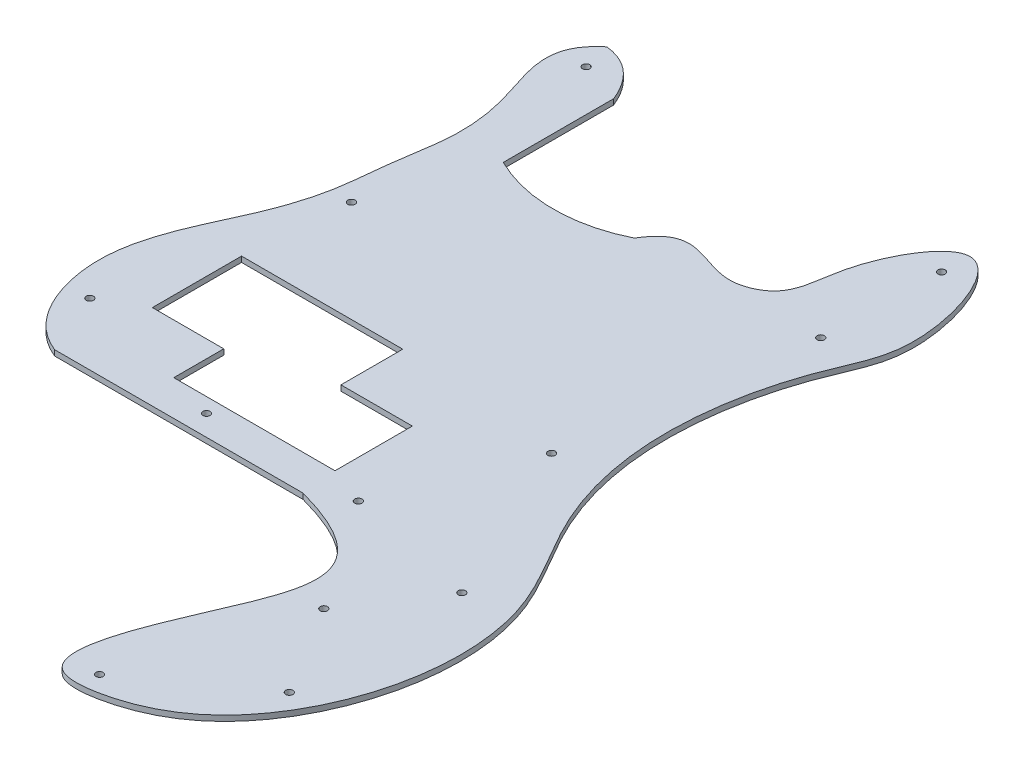
ISO-10303-21;
HEADER;
FILE_DESCRIPTION(('STEP AP214'),'2;1');
FILE_NAME('part.step','',(''),(''),'','','');
FILE_SCHEMA(('AUTOMOTIVE_DESIGN { 1 0 10303 214 1 1 1 1 }'));
ENDSEC;
DATA;
#1=APPLICATION_CONTEXT('core data for automotive mechanical design processes');
#2=APPLICATION_PROTOCOL_DEFINITION('international standard','automotive_design',2000,#1);
#3=PRODUCT_CONTEXT('',#1,'mechanical');
#4=PRODUCT('Part','Part','',(#3));
#5=PRODUCT_RELATED_PRODUCT_CATEGORY('part','',(#4));
#6=PRODUCT_DEFINITION_FORMATION('','',#4);
#7=PRODUCT_DEFINITION_CONTEXT('part definition',#1,'design');
#8=PRODUCT_DEFINITION('design','',#6,#7);
#9=PRODUCT_DEFINITION_SHAPE('','',#8);
#10=(LENGTH_UNIT() NAMED_UNIT(*) SI_UNIT(.MILLI.,.METRE.));
#11=(NAMED_UNIT(*) PLANE_ANGLE_UNIT() SI_UNIT($,.RADIAN.));
#12=(NAMED_UNIT(*) SI_UNIT($,.STERADIAN.) SOLID_ANGLE_UNIT());
#13=UNCERTAINTY_MEASURE_WITH_UNIT(LENGTH_MEASURE(1.E-05),#10,'distance_accuracy_value','');
#14=(GEOMETRIC_REPRESENTATION_CONTEXT(3) GLOBAL_UNCERTAINTY_ASSIGNED_CONTEXT((#13)) GLOBAL_UNIT_ASSIGNED_CONTEXT((#10,
#11,#12)) REPRESENTATION_CONTEXT('',''));
#15=CARTESIAN_POINT('',(0.,0.,0.));
#16=DIRECTION('',(0.,0.,1.));
#17=DIRECTION('',(1.,0.,0.));
#18=AXIS2_PLACEMENT_3D('',#15,#16,#17);
#19=CARTESIAN_POINT('',(0.,2.54,0.));
#20=DIRECTION('',(0.,0.,-1.));
#21=DIRECTION('',(-1.,0.,0.));
#22=AXIS2_PLACEMENT_3D('',#19,#20,#21);
#23=PLANE('',#22);
#24=DIRECTION('',(1.,0.,0.));
#25=VECTOR('',#24,1.);
#26=CARTESIAN_POINT('',(0.,0.,0.));
#27=LINE('',#26,#25);
#28=CARTESIAN_POINT('',(0.,0.,0.));
#29=VERTEX_POINT('',#28);
#30=CARTESIAN_POINT('',(114.3,0.,0.));
#31=VERTEX_POINT('',#30);
#32=EDGE_CURVE('E365',#29,#31,#27,.T.);
#33=ORIENTED_EDGE('',*,*,#32,.T.);
#34=DIRECTION('',(0.,-1.,0.));
#35=VECTOR('',#34,1.);
#36=CARTESIAN_POINT('',(114.3,2.54,0.));
#37=LINE('',#36,#35);
#38=CARTESIAN_POINT('',(114.3,2.54,0.));
#39=VERTEX_POINT('',#38);
#40=EDGE_CURVE('E11',#39,#31,#37,.T.);
#41=ORIENTED_EDGE('',*,*,#40,.F.);
#42=DIRECTION('',(1.,0.,0.));
#43=VECTOR('',#42,1.);
#44=CARTESIAN_POINT('',(0.,2.54,0.));
#45=LINE('',#44,#43);
#46=CARTESIAN_POINT('',(0.,2.54,0.));
#47=VERTEX_POINT('',#46);
#48=EDGE_CURVE('E252',#47,#39,#45,.T.);
#49=ORIENTED_EDGE('',*,*,#48,.F.);
#50=DIRECTION('',(0.,-1.,0.));
#51=VECTOR('',#50,1.);
#52=CARTESIAN_POINT('',(0.,2.54,0.));
#53=LINE('',#52,#51);
#54=EDGE_CURVE('E394',#47,#29,#53,.T.);
#55=ORIENTED_EDGE('',*,*,#54,.T.);
#56=EDGE_LOOP('',(#33,#41,#49,#55));
#57=FACE_BOUND('',#56,.T.);
#58=ADVANCED_FACE('F45',(#57),#23,.F.);
#59=CARTESIAN_POINT('',(114.3,2.54,0.));
#60=CARTESIAN_POINT('',(170.62319211353,2.54,15.3244998269789));
#61=CARTESIAN_POINT('',(142.778538687645,2.54,51.01482615215));
#62=CARTESIAN_POINT('',(117.07237008496,2.54,130.865354033399));
#63=CARTESIAN_POINT('',(166.910373226998,2.54,124.747305795916));
#64=CARTESIAN_POINT('',(211.27004330373,2.54,85.6480945359383));
#65=CARTESIAN_POINT('',(223.254152948572,2.54,5.84316240995028));
#66=CARTESIAN_POINT('',(185.826230853878,2.54,-45.0846803202027));
#67=CARTESIAN_POINT('',(168.892743993286,2.54,-100.701866142088));
#68=CARTESIAN_POINT('',(177.456556307914,2.54,-154.682991229981));
#69=CARTESIAN_POINT('',(201.016482926726,2.54,-201.558360825542));
#70=CARTESIAN_POINT('',(177.939980570624,2.54,-271.83735916786));
#71=CARTESIAN_POINT('',(147.118130497066,2.54,-218.136283800115));
#72=CARTESIAN_POINT('',(148.12807589294,2.54,-189.82980196272));
#73=CARTESIAN_POINT('',(118.716390008098,2.54,-176.497868685081));
#74=CARTESIAN_POINT('',(100.979559676119,2.54,-198.21058265065));
#75=CARTESIAN_POINT('',(88.9,2.54,-177.8));
#76=B_SPLINE_CURVE_WITH_KNOTS('',3,(#59,#60,#61,#62,#63,#64,#65,#66,#67,#68,#69,#70,#71,#72,#73,
#74,#75),.UNSPECIFIED.,.F.,.F.,(4,1,1,1,1,1,1,1,1,1,1,1,1,1,4),(0.,0.148092664495598,
0.210362687240337,0.240168738073211,0.321979976329545,0.461111394362021,0.528032739151517,
0.586689277761281,0.706181910966103,0.742682380383106,0.823050715857984,0.881913078401273,
0.917688904837905,0.939312918195722,1.),.UNSPECIFIED.);
#77=DIRECTION('',(0.,-1.,0.));
#78=VECTOR('',#77,1.);
#79=SURFACE_OF_LINEAR_EXTRUSION('',#76,#78);
#80=CARTESIAN_POINT('',(114.3,0.,0.));
#81=CARTESIAN_POINT('',(170.62319211353,0.,15.3244998269789));
#82=CARTESIAN_POINT('',(142.778538687645,0.,51.01482615215));
#83=CARTESIAN_POINT('',(117.07237008496,0.,130.865354033399));
#84=CARTESIAN_POINT('',(166.910373226998,0.,124.747305795916));
#85=CARTESIAN_POINT('',(211.27004330373,0.,85.6480945359383));
#86=CARTESIAN_POINT('',(223.254152948572,0.,5.84316240995028));
#87=CARTESIAN_POINT('',(185.826230853878,0.,-45.0846803202027));
#88=CARTESIAN_POINT('',(168.892743993286,0.,-100.701866142088));
#89=CARTESIAN_POINT('',(177.456556307914,0.,-154.682991229981));
#90=CARTESIAN_POINT('',(201.016482926726,0.,-201.558360825542));
#91=CARTESIAN_POINT('',(177.939980570624,0.,-271.83735916786));
#92=CARTESIAN_POINT('',(147.118130497066,0.,-218.136283800115));
#93=CARTESIAN_POINT('',(148.12807589294,0.,-189.82980196272));
#94=CARTESIAN_POINT('',(118.716390008098,0.,-176.497868685081));
#95=CARTESIAN_POINT('',(100.979559676119,0.,-198.21058265065));
#96=CARTESIAN_POINT('',(88.9,0.,-177.8));
#97=B_SPLINE_CURVE_WITH_KNOTS('',3,(#80,#81,#82,#83,#84,#85,#86,#87,#88,#89,#90,#91,#92,#93,#94,
#95,#96),.UNSPECIFIED.,.F.,.F.,(4,1,1,1,1,1,1,1,1,1,1,1,1,1,4),(0.,0.148092664495598,
0.210362687240337,0.240168738073211,0.321979976329545,0.461111394362021,0.528032739151517,
0.586689277761281,0.706181910966103,0.742682380383106,0.823050715857984,0.881913078401273,
0.917688904837905,0.939312918195722,1.),.UNSPECIFIED.);
#98=CARTESIAN_POINT('',(88.9,0.,-177.8));
#99=VERTEX_POINT('',#98);
#100=EDGE_CURVE('E368',#31,#99,#97,.T.);
#101=ORIENTED_EDGE('',*,*,#100,.T.);
#102=DIRECTION('',(0.,-1.,0.));
#103=VECTOR('',#102,1.);
#104=CARTESIAN_POINT('',(88.9,2.54,-177.8));
#105=LINE('',#104,#103);
#106=CARTESIAN_POINT('',(88.9,2.54,-177.8));
#107=VERTEX_POINT('',#106);
#108=EDGE_CURVE('E53',#107,#99,#105,.T.);
#109=ORIENTED_EDGE('',*,*,#108,.F.);
#110=EDGE_CURVE('E255',#39,#107,#76,.T.);
#111=ORIENTED_EDGE('',*,*,#110,.F.);
#112=ORIENTED_EDGE('',*,*,#40,.T.);
#113=EDGE_LOOP('',(#101,#109,#111,#112));
#114=FACE_BOUND('',#113,.T.);
#115=ADVANCED_FACE('F266',(#114),#79,.F.);
#116=CARTESIAN_POINT('',(58.7375,2.54,-238.204658482143));
#117=DIRECTION('',(0.,-1.,0.));
#118=DIRECTION('',(0.,0.,-1.));
#119=AXIS2_PLACEMENT_3D('',#116,#117,#118);
#120=CYLINDRICAL_SURFACE('',#119,67.5166584821429);
#121=CARTESIAN_POINT('',(58.7375,0.,-238.204658482143));
#122=DIRECTION('',(0.,1.,0.));
#123=DIRECTION('',(0.,0.,1.));
#124=AXIS2_PLACEMENT_3D('',#121,#122,#123);
#125=CIRCLE('',#124,67.5166584821429);
#126=CARTESIAN_POINT('',(28.575,0.,-177.8));
#127=VERTEX_POINT('',#126);
#128=EDGE_CURVE('E373',#127,#99,#125,.T.);
#129=ORIENTED_EDGE('',*,*,#128,.F.);
#130=DIRECTION('',(0.,-1.,0.));
#131=VECTOR('',#130,1.);
#132=CARTESIAN_POINT('',(28.575,2.54,-177.8));
#133=LINE('',#132,#131);
#134=CARTESIAN_POINT('',(28.575,2.54,-177.8));
#135=VERTEX_POINT('',#134);
#136=EDGE_CURVE('E404',#135,#127,#133,.T.);
#137=ORIENTED_EDGE('',*,*,#136,.F.);
#138=CARTESIAN_POINT('',(58.7375,2.54,-238.204658482143));
#139=DIRECTION('',(0.,1.,0.));
#140=DIRECTION('',(0.,0.,1.));
#141=AXIS2_PLACEMENT_3D('',#138,#139,#140);
#142=CIRCLE('',#141,67.5166584821429);
#143=EDGE_CURVE('E260',#135,#107,#142,.T.);
#144=ORIENTED_EDGE('',*,*,#143,.T.);
#145=ORIENTED_EDGE('',*,*,#108,.T.);
#146=EDGE_LOOP('',(#129,#137,#144,#145));
#147=FACE_BOUND('',#146,.T.);
#148=ADVANCED_FACE('F270',(#147),#120,.F.);
#149=CARTESIAN_POINT('',(28.575,2.54,0.));
#150=DIRECTION('',(1.,0.,0.));
#151=DIRECTION('',(0.,0.,-1.));
#152=AXIS2_PLACEMENT_3D('',#149,#150,#151);
#153=PLANE('',#152);
#154=DIRECTION('',(0.,0.,1.));
#155=VECTOR('',#154,1.);
#156=CARTESIAN_POINT('',(28.575,0.,0.));
#157=LINE('',#156,#155);
#158=CARTESIAN_POINT('',(28.575,0.,-228.6));
#159=VERTEX_POINT('',#158);
#160=EDGE_CURVE('E379',#159,#127,#157,.T.);
#161=ORIENTED_EDGE('',*,*,#160,.F.);
#162=DIRECTION('',(0.,-1.,0.));
#163=VECTOR('',#162,1.);
#164=CARTESIAN_POINT('',(28.575,2.54,-228.6));
#165=LINE('',#164,#163);
#166=CARTESIAN_POINT('',(28.575,2.54,-228.6));
#167=VERTEX_POINT('',#166);
#168=EDGE_CURVE('E402',#167,#159,#165,.T.);
#169=ORIENTED_EDGE('',*,*,#168,.F.);
#170=DIRECTION('',(0.,0.,1.));
#171=VECTOR('',#170,1.);
#172=CARTESIAN_POINT('',(28.575,2.54,0.));
#173=LINE('',#172,#171);
#174=EDGE_CURVE('E419',#167,#135,#173,.T.);
#175=ORIENTED_EDGE('',*,*,#174,.T.);
#176=ORIENTED_EDGE('',*,*,#136,.T.);
#177=EDGE_LOOP('',(#161,#169,#175,#176));
#178=FACE_BOUND('',#177,.T.);
#179=ADVANCED_FACE('F416',(#178),#153,.T.);
#180=CARTESIAN_POINT('',(6.35000000000001,2.54,-247.65));
#181=CARTESIAN_POINT('',(21.4241263145795,2.54,-246.03002734654));
#182=CARTESIAN_POINT('',(28.575,2.54,-228.6));
#183=B_SPLINE_CURVE_WITH_KNOTS('',2,(#180,#181,#182),.UNSPECIFIED.,.F.,.F.,(3,3),(0.,1.),.UNSPECIFIED.);
#184=DIRECTION('',(0.,-1.,0.));
#185=VECTOR('',#184,1.);
#186=SURFACE_OF_LINEAR_EXTRUSION('',#183,#185);
#187=CARTESIAN_POINT('',(6.35000000000001,0.,-247.65));
#188=CARTESIAN_POINT('',(21.4241263145795,0.,-246.03002734654));
#189=CARTESIAN_POINT('',(28.575,0.,-228.6));
#190=B_SPLINE_CURVE_WITH_KNOTS('',2,(#187,#188,#189),.UNSPECIFIED.,.F.,.F.,(3,3),(0.,1.),.UNSPECIFIED.);
#191=CARTESIAN_POINT('',(6.35000000000001,0.,-247.65));
#192=VERTEX_POINT('',#191);
#193=EDGE_CURVE('E382',#192,#159,#190,.T.);
#194=ORIENTED_EDGE('',*,*,#193,.F.);
#195=DIRECTION('',(0.,-1.,0.));
#196=VECTOR('',#195,1.);
#197=CARTESIAN_POINT('',(6.35000000000001,2.54,-247.65));
#198=LINE('',#197,#196);
#199=CARTESIAN_POINT('',(6.35000000000001,2.54,-247.65));
#200=VERTEX_POINT('',#199);
#201=EDGE_CURVE('E399',#200,#192,#198,.T.);
#202=ORIENTED_EDGE('',*,*,#201,.F.);
#203=EDGE_CURVE('E424',#200,#167,#183,.T.);
#204=ORIENTED_EDGE('',*,*,#203,.T.);
#205=ORIENTED_EDGE('',*,*,#168,.T.);
#206=EDGE_LOOP('',(#194,#202,#204,#205));
#207=FACE_BOUND('',#206,.T.);
#208=ADVANCED_FACE('F280',(#207),#186,.T.);
#209=CARTESIAN_POINT('',(165.1,2.54,41.275));
#210=DIRECTION('',(0.,-1.,0.));
#211=DIRECTION('',(0.,0.,-1.));
#212=AXIS2_PLACEMENT_3D('',#209,#210,#211);
#213=CYLINDRICAL_SURFACE('',#212,1.67639999999999);
#214=CARTESIAN_POINT('',(165.1,2.54,41.275));
#215=DIRECTION('',(0.,1.,0.));
#216=DIRECTION('',(0.,0.,1.));
#217=AXIS2_PLACEMENT_3D('',#214,#215,#216);
#218=CIRCLE('',#217,1.67639999999999);
#219=CARTESIAN_POINT('',(165.1,2.54,42.9514));
#220=VERTEX_POINT('',#219);
#221=EDGE_CURVE('E249',#220,#220,#218,.T.);
#222=ORIENTED_EDGE('',*,*,#221,.T.);
#223=EDGE_LOOP('',(#222));
#224=FACE_BOUND('',#223,.T.);
#225=CARTESIAN_POINT('',(165.1,0.,41.275));
#226=DIRECTION('',(0.,1.,0.));
#227=DIRECTION('',(0.,0.,1.));
#228=AXIS2_PLACEMENT_3D('',#225,#226,#227);
#229=CIRCLE('',#228,1.67639999999999);
#230=CARTESIAN_POINT('',(165.1,0.,42.9514));
#231=VERTEX_POINT('',#230);
#232=EDGE_CURVE('E362',#231,#231,#229,.T.);
#233=ORIENTED_EDGE('',*,*,#232,.F.);
#234=EDGE_LOOP('',(#233));
#235=FACE_BOUND('',#234,.T.);
#236=ADVANCED_FACE('F276',(#224,#235),#213,.F.);
#237=CARTESIAN_POINT('',(139.7,2.54,119.0625));
#238=DIRECTION('',(0.,-1.,0.));
#239=DIRECTION('',(0.,0.,-1.));
#240=AXIS2_PLACEMENT_3D('',#237,#238,#239);
#241=CYLINDRICAL_SURFACE('',#240,1.67639999999999);
#242=CARTESIAN_POINT('',(139.7,2.54,119.0625));
#243=DIRECTION('',(0.,1.,0.));
#244=DIRECTION('',(0.,0.,1.));
#245=AXIS2_PLACEMENT_3D('',#242,#243,#244);
#246=CIRCLE('',#245,1.67639999999999);
#247=CARTESIAN_POINT('',(139.7,2.54,120.7389));
#248=VERTEX_POINT('',#247);
#249=EDGE_CURVE('E246',#248,#248,#246,.T.);
#250=ORIENTED_EDGE('',*,*,#249,.T.);
#251=EDGE_LOOP('',(#250));
#252=FACE_BOUND('',#251,.T.);
#253=CARTESIAN_POINT('',(139.7,0.,119.0625));
#254=DIRECTION('',(0.,1.,0.));
#255=DIRECTION('',(0.,0.,1.));
#256=AXIS2_PLACEMENT_3D('',#253,#254,#255);
#257=CIRCLE('',#256,1.67639999999999);
#258=CARTESIAN_POINT('',(139.7,0.,120.7389));
#259=VERTEX_POINT('',#258);
#260=EDGE_CURVE('E359',#259,#259,#257,.T.);
#261=ORIENTED_EDGE('',*,*,#260,.F.);
#262=EDGE_LOOP('',(#261));
#263=FACE_BOUND('',#262,.T.);
#264=ADVANCED_FACE('F279',(#252,#263),#241,.F.);
#265=CARTESIAN_POINT('',(190.5,2.54,82.55));
#266=DIRECTION('',(0.,-1.,0.));
#267=DIRECTION('',(0.,0.,-1.));
#268=AXIS2_PLACEMENT_3D('',#265,#266,#267);
#269=CYLINDRICAL_SURFACE('',#268,1.67639999999999);
#270=CARTESIAN_POINT('',(190.5,2.54,82.55));
#271=DIRECTION('',(0.,1.,0.));
#272=DIRECTION('',(0.,0.,1.));
#273=AXIS2_PLACEMENT_3D('',#270,#271,#272);
#274=CIRCLE('',#273,1.67639999999999);
#275=CARTESIAN_POINT('',(190.5,2.54,84.2264));
#276=VERTEX_POINT('',#275);
#277=EDGE_CURVE('E243',#276,#276,#274,.T.);
#278=ORIENTED_EDGE('',*,*,#277,.T.);
#279=EDGE_LOOP('',(#278));
#280=FACE_BOUND('',#279,.T.);
#281=CARTESIAN_POINT('',(190.5,0.,82.55));
#282=DIRECTION('',(0.,1.,0.));
#283=DIRECTION('',(0.,0.,1.));
#284=AXIS2_PLACEMENT_3D('',#281,#282,#283);
#285=CIRCLE('',#284,1.67639999999999);
#286=CARTESIAN_POINT('',(190.5,0.,84.2264));
#287=VERTEX_POINT('',#286);
#288=EDGE_CURVE('E356',#287,#287,#285,.T.);
#289=ORIENTED_EDGE('',*,*,#288,.F.);
#290=EDGE_LOOP('',(#289));
#291=FACE_BOUND('',#290,.T.);
#292=ADVANCED_FACE('F284',(#280,#291),#269,.F.);
#293=CARTESIAN_POINT('',(190.5,2.54,3.175));
#294=DIRECTION('',(0.,-1.,0.));
#295=DIRECTION('',(0.,0.,-1.));
#296=AXIS2_PLACEMENT_3D('',#293,#294,#295);
#297=CYLINDRICAL_SURFACE('',#296,1.67639999999999);
#298=CARTESIAN_POINT('',(190.5,2.54,3.175));
#299=DIRECTION('',(0.,1.,0.));
#300=DIRECTION('',(0.,0.,1.));
#301=AXIS2_PLACEMENT_3D('',#298,#299,#300);
#302=CIRCLE('',#301,1.67639999999999);
#303=CARTESIAN_POINT('',(190.5,2.54,4.8514));
#304=VERTEX_POINT('',#303);
#305=EDGE_CURVE('E240',#304,#304,#302,.T.);
#306=ORIENTED_EDGE('',*,*,#305,.T.);
#307=EDGE_LOOP('',(#306));
#308=FACE_BOUND('',#307,.T.);
#309=CARTESIAN_POINT('',(190.5,0.,3.175));
#310=DIRECTION('',(0.,1.,0.));
#311=DIRECTION('',(0.,0.,1.));
#312=AXIS2_PLACEMENT_3D('',#309,#310,#311);
#313=CIRCLE('',#312,1.67639999999999);
#314=CARTESIAN_POINT('',(190.5,0.,4.8514));
#315=VERTEX_POINT('',#314);
#316=EDGE_CURVE('E353',#315,#315,#313,.T.);
#317=ORIENTED_EDGE('',*,*,#316,.F.);
#318=EDGE_LOOP('',(#317));
#319=FACE_BOUND('',#318,.T.);
#320=ADVANCED_FACE('F288',(#308,#319),#297,.F.);
#321=CARTESIAN_POINT('',(155.575,2.54,-73.0250000000012));
#322=DIRECTION('',(0.,-1.,0.));
#323=DIRECTION('',(0.,0.,-1.));
#324=AXIS2_PLACEMENT_3D('',#321,#322,#323);
#325=CYLINDRICAL_SURFACE('',#324,1.67640000000113);
#326=CARTESIAN_POINT('',(155.575,2.54,-73.0250000000012));
#327=DIRECTION('',(0.,1.,0.));
#328=DIRECTION('',(0.,0.,1.));
#329=AXIS2_PLACEMENT_3D('',#326,#327,#328);
#330=CIRCLE('',#329,1.67640000000113);
#331=CARTESIAN_POINT('',(155.575,2.54,-71.3486000000001));
#332=VERTEX_POINT('',#331);
#333=EDGE_CURVE('E237',#332,#332,#330,.T.);
#334=ORIENTED_EDGE('',*,*,#333,.T.);
#335=EDGE_LOOP('',(#334));
#336=FACE_BOUND('',#335,.T.);
#337=CARTESIAN_POINT('',(155.575,0.,-73.0250000000012));
#338=DIRECTION('',(0.,1.,0.));
#339=DIRECTION('',(0.,0.,1.));
#340=AXIS2_PLACEMENT_3D('',#337,#338,#339);
#341=CIRCLE('',#340,1.67640000000113);
#342=CARTESIAN_POINT('',(155.575,0.,-71.3486000000001));
#343=VERTEX_POINT('',#342);
#344=EDGE_CURVE('E350',#343,#343,#341,.T.);
#345=ORIENTED_EDGE('',*,*,#344,.F.);
#346=EDGE_LOOP('',(#345));
#347=FACE_BOUND('',#346,.T.);
#348=ADVANCED_FACE('F292',(#336,#347),#325,.F.);
#349=CARTESIAN_POINT('',(171.45,2.54,-180.975));
#350=DIRECTION('',(0.,-1.,0.));
#351=DIRECTION('',(0.,0.,-1.));
#352=AXIS2_PLACEMENT_3D('',#349,#350,#351);
#353=CYLINDRICAL_SURFACE('',#352,1.67639999999999);
#354=CARTESIAN_POINT('',(171.45,2.54,-180.975));
#355=DIRECTION('',(0.,1.,0.));
#356=DIRECTION('',(0.,0.,1.));
#357=AXIS2_PLACEMENT_3D('',#354,#355,#356);
#358=CIRCLE('',#357,1.67639999999999);
#359=CARTESIAN_POINT('',(171.45,2.54,-179.2986));
#360=VERTEX_POINT('',#359);
#361=EDGE_CURVE('E234',#360,#360,#358,.T.);
#362=ORIENTED_EDGE('',*,*,#361,.T.);
#363=EDGE_LOOP('',(#362));
#364=FACE_BOUND('',#363,.T.);
#365=CARTESIAN_POINT('',(171.45,0.,-180.975));
#366=DIRECTION('',(0.,1.,0.));
#367=DIRECTION('',(0.,0.,1.));
#368=AXIS2_PLACEMENT_3D('',#365,#366,#367);
#369=CIRCLE('',#368,1.67639999999999);
#370=CARTESIAN_POINT('',(171.45,0.,-179.2986));
#371=VERTEX_POINT('',#370);
#372=EDGE_CURVE('E347',#371,#371,#369,.T.);
#373=ORIENTED_EDGE('',*,*,#372,.F.);
#374=EDGE_LOOP('',(#373));
#375=FACE_BOUND('',#374,.T.);
#376=ADVANCED_FACE('F296',(#364,#375),#353,.F.);
#377=CARTESIAN_POINT('',(173.0375,2.54,-234.95));
#378=DIRECTION('',(0.,-1.,0.));
#379=DIRECTION('',(0.,0.,-1.));
#380=AXIS2_PLACEMENT_3D('',#377,#378,#379);
#381=CYLINDRICAL_SURFACE('',#380,1.67639999999999);
#382=CARTESIAN_POINT('',(173.0375,2.54,-234.95));
#383=DIRECTION('',(0.,1.,0.));
#384=DIRECTION('',(0.,0.,1.));
#385=AXIS2_PLACEMENT_3D('',#382,#383,#384);
#386=CIRCLE('',#385,1.67639999999999);
#387=CARTESIAN_POINT('',(173.0375,2.54,-233.2736));
#388=VERTEX_POINT('',#387);
#389=EDGE_CURVE('E231',#388,#388,#386,.T.);
#390=ORIENTED_EDGE('',*,*,#389,.T.);
#391=EDGE_LOOP('',(#390));
#392=FACE_BOUND('',#391,.T.);
#393=CARTESIAN_POINT('',(173.0375,0.,-234.95));
#394=DIRECTION('',(0.,1.,0.));
#395=DIRECTION('',(0.,0.,1.));
#396=AXIS2_PLACEMENT_3D('',#393,#394,#395);
#397=CIRCLE('',#396,1.67639999999999);
#398=CARTESIAN_POINT('',(173.0375,0.,-233.2736));
#399=VERTEX_POINT('',#398);
#400=EDGE_CURVE('E344',#399,#399,#397,.T.);
#401=ORIENTED_EDGE('',*,*,#400,.F.);
#402=EDGE_LOOP('',(#401));
#403=FACE_BOUND('',#402,.T.);
#404=ADVANCED_FACE('F300',(#392,#403),#381,.F.);
#405=CARTESIAN_POINT('',(9.52500000000001,2.54,-234.95));
#406=DIRECTION('',(0.,-1.,0.));
#407=DIRECTION('',(0.,0.,-1.));
#408=AXIS2_PLACEMENT_3D('',#405,#406,#407);
#409=CYLINDRICAL_SURFACE('',#408,1.6764);
#410=CARTESIAN_POINT('',(9.52500000000001,2.54,-234.95));
#411=DIRECTION('',(0.,1.,0.));
#412=DIRECTION('',(0.,0.,1.));
#413=AXIS2_PLACEMENT_3D('',#410,#411,#412);
#414=CIRCLE('',#413,1.6764);
#415=CARTESIAN_POINT('',(9.52500000000001,2.54,-233.2736));
#416=VERTEX_POINT('',#415);
#417=EDGE_CURVE('E228',#416,#416,#414,.T.);
#418=ORIENTED_EDGE('',*,*,#417,.T.);
#419=EDGE_LOOP('',(#418));
#420=FACE_BOUND('',#419,.T.);
#421=CARTESIAN_POINT('',(9.52500000000001,0.,-234.95));
#422=DIRECTION('',(0.,1.,0.));
#423=DIRECTION('',(0.,0.,1.));
#424=AXIS2_PLACEMENT_3D('',#421,#422,#423);
#425=CIRCLE('',#424,1.6764);
#426=CARTESIAN_POINT('',(9.52500000000001,0.,-233.2736));
#427=VERTEX_POINT('',#426);
#428=EDGE_CURVE('E341',#427,#427,#425,.T.);
#429=ORIENTED_EDGE('',*,*,#428,.F.);
#430=EDGE_LOOP('',(#429));
#431=FACE_BOUND('',#430,.T.);
#432=ADVANCED_FACE('F304',(#420,#431),#409,.F.);
#433=CARTESIAN_POINT('',(9.52500000000001,2.54,-127.));
#434=DIRECTION('',(0.,-1.,0.));
#435=DIRECTION('',(0.,0.,-1.));
#436=AXIS2_PLACEMENT_3D('',#433,#434,#435);
#437=CYLINDRICAL_SURFACE('',#436,1.6764);
#438=CARTESIAN_POINT('',(9.52500000000001,2.54,-127.));
#439=DIRECTION('',(0.,1.,0.));
#440=DIRECTION('',(0.,0.,1.));
#441=AXIS2_PLACEMENT_3D('',#438,#439,#440);
#442=CIRCLE('',#441,1.6764);
#443=CARTESIAN_POINT('',(9.52500000000001,2.54,-125.3236));
#444=VERTEX_POINT('',#443);
#445=EDGE_CURVE('E225',#444,#444,#442,.T.);
#446=ORIENTED_EDGE('',*,*,#445,.T.);
#447=EDGE_LOOP('',(#446));
#448=FACE_BOUND('',#447,.T.);
#449=CARTESIAN_POINT('',(9.52500000000001,0.,-127.));
#450=DIRECTION('',(0.,1.,0.));
#451=DIRECTION('',(0.,0.,1.));
#452=AXIS2_PLACEMENT_3D('',#449,#450,#451);
#453=CIRCLE('',#452,1.6764);
#454=CARTESIAN_POINT('',(9.52500000000001,0.,-125.3236));
#455=VERTEX_POINT('',#454);
#456=EDGE_CURVE('E333',#455,#455,#453,.T.);
#457=ORIENTED_EDGE('',*,*,#456,.F.);
#458=EDGE_LOOP('',(#457));
#459=FACE_BOUND('',#458,.T.);
#460=ADVANCED_FACE('F308',(#448,#459),#437,.F.);
#461=CARTESIAN_POINT('',(-12.3825,2.54,-28.575));
#462=DIRECTION('',(0.,-1.,0.));
#463=DIRECTION('',(0.,0.,-1.));
#464=AXIS2_PLACEMENT_3D('',#461,#462,#463);
#465=CYLINDRICAL_SURFACE('',#464,1.6764);
#466=CARTESIAN_POINT('',(-12.3825,2.54,-28.575));
#467=DIRECTION('',(0.,1.,0.));
#468=DIRECTION('',(0.,0.,1.));
#469=AXIS2_PLACEMENT_3D('',#466,#467,#468);
#470=CIRCLE('',#469,1.6764);
#471=CARTESIAN_POINT('',(-12.3825,2.54,-26.8986));
#472=VERTEX_POINT('',#471);
#473=EDGE_CURVE('E222',#472,#472,#470,.T.);
#474=ORIENTED_EDGE('',*,*,#473,.T.);
#475=EDGE_LOOP('',(#474));
#476=FACE_BOUND('',#475,.T.);
#477=CARTESIAN_POINT('',(-12.3825,0.,-28.575));
#478=DIRECTION('',(0.,1.,0.));
#479=DIRECTION('',(0.,0.,1.));
#480=AXIS2_PLACEMENT_3D('',#477,#478,#479);
#481=CIRCLE('',#480,1.6764);
#482=CARTESIAN_POINT('',(-12.3825,0.,-26.8986));
#483=VERTEX_POINT('',#482);
#484=EDGE_CURVE('E330',#483,#483,#481,.T.);
#485=ORIENTED_EDGE('',*,*,#484,.F.);
#486=EDGE_LOOP('',(#485));
#487=FACE_BOUND('',#486,.T.);
#488=ADVANCED_FACE('F312',(#476,#487),#465,.F.);
#489=CARTESIAN_POINT('',(130.175,2.54,-9.525));
#490=DIRECTION('',(0.,-1.,0.));
#491=DIRECTION('',(0.,0.,-1.));
#492=AXIS2_PLACEMENT_3D('',#489,#490,#491);
#493=CYLINDRICAL_SURFACE('',#492,1.67639999999999);
#494=CARTESIAN_POINT('',(130.175,2.54,-9.525));
#495=DIRECTION('',(0.,1.,0.));
#496=DIRECTION('',(0.,0.,1.));
#497=AXIS2_PLACEMENT_3D('',#494,#495,#496);
#498=CIRCLE('',#497,1.67639999999999);
#499=CARTESIAN_POINT('',(130.175,2.54,-7.84860000000001));
#500=VERTEX_POINT('',#499);
#501=EDGE_CURVE('E218',#500,#500,#498,.T.);
#502=ORIENTED_EDGE('',*,*,#501,.T.);
#503=EDGE_LOOP('',(#502));
#504=FACE_BOUND('',#503,.T.);
#505=CARTESIAN_POINT('',(130.175,0.,-9.525));
#506=DIRECTION('',(0.,1.,0.));
#507=DIRECTION('',(0.,0.,1.));
#508=AXIS2_PLACEMENT_3D('',#505,#506,#507);
#509=CIRCLE('',#508,1.67639999999999);
#510=CARTESIAN_POINT('',(130.175,0.,-7.84860000000001));
#511=VERTEX_POINT('',#510);
#512=EDGE_CURVE('E328',#511,#511,#509,.T.);
#513=ORIENTED_EDGE('',*,*,#512,.F.);
#514=EDGE_LOOP('',(#513));
#515=FACE_BOUND('',#514,.T.);
#516=ADVANCED_FACE('F315',(#504,#515),#493,.F.);
#517=CARTESIAN_POINT('',(60.325,2.54,-9.52500000000001));
#518=DIRECTION('',(0.,-1.,0.));
#519=DIRECTION('',(0.,0.,-1.));
#520=AXIS2_PLACEMENT_3D('',#517,#518,#519);
#521=CYLINDRICAL_SURFACE('',#520,1.67640000000009);
#522=CARTESIAN_POINT('',(60.325,2.54,-9.52500000000001));
#523=DIRECTION('',(0.,1.,0.));
#524=DIRECTION('',(0.,0.,1.));
#525=AXIS2_PLACEMENT_3D('',#522,#523,#524);
#526=CIRCLE('',#525,1.67640000000009);
#527=CARTESIAN_POINT('',(60.325,2.54,-7.84859999999992));
#528=VERTEX_POINT('',#527);
#529=EDGE_CURVE('E215',#528,#528,#526,.T.);
#530=ORIENTED_EDGE('',*,*,#529,.T.);
#531=EDGE_LOOP('',(#530));
#532=FACE_BOUND('',#531,.T.);
#533=CARTESIAN_POINT('',(60.325,0.,-9.52500000000001));
#534=DIRECTION('',(0.,1.,0.));
#535=DIRECTION('',(0.,0.,1.));
#536=AXIS2_PLACEMENT_3D('',#533,#534,#535);
#537=CIRCLE('',#536,1.67640000000009);
#538=CARTESIAN_POINT('',(60.325,0.,-7.84859999999992));
#539=VERTEX_POINT('',#538);
#540=EDGE_CURVE('E203',#539,#539,#537,.T.);
#541=ORIENTED_EDGE('',*,*,#540,.F.);
#542=EDGE_LOOP('',(#541));
#543=FACE_BOUND('',#542,.T.);
#544=ADVANCED_FACE('F47',(#532,#543),#521,.F.);
#545=CARTESIAN_POINT('',(0.,2.54,0.));
#546=CARTESIAN_POINT('',(-11.5300091087343,2.54,-4.51445861340867));
#547=CARTESIAN_POINT('',(-23.59811648345,2.54,-21.7648643378287));
#548=CARTESIAN_POINT('',(-27.1419218330297,2.54,-51.1960868146924));
#549=CARTESIAN_POINT('',(-19.6130775119381,2.54,-77.0697720099895));
#550=CARTESIAN_POINT('',(-7.49782478004287,2.54,-100.945161618409));
#551=CARTESIAN_POINT('',(1.09873972655993,2.54,-126.482448193633));
#552=CARTESIAN_POINT('',(2.5385633923787,2.54,-152.451362426365));
#553=CARTESIAN_POINT('',(7.77824839723955,2.54,-177.773773964597));
#554=CARTESIAN_POINT('',(3.49959619787633,2.54,-210.514145226834));
#555=CARTESIAN_POINT('',(-10.0480190937917,2.54,-234.32488139789));
#556=CARTESIAN_POINT('',(6.35000000000001,2.54,-247.65));
#557=B_SPLINE_CURVE_WITH_KNOTS('',3,(#545,#546,#547,#548,#549,#550,#551,#552,#553,#554,#555,
#556),.UNSPECIFIED.,.F.,.F.,(4,1,1,1,1,1,1,1,1,4),(0.,0.130338526345939,0.226963597869798,
0.325793327311234,0.430446662667914,0.530898136785145,0.627523208309004,0.724148279832863,
0.820773351356722,1.),.UNSPECIFIED.);
#558=DIRECTION('',(0.,-1.,0.));
#559=VECTOR('',#558,1.);
#560=SURFACE_OF_LINEAR_EXTRUSION('',#557,#559);
#561=CARTESIAN_POINT('',(0.,0.,0.));
#562=CARTESIAN_POINT('',(-11.5300091087343,0.,-4.51445861340867));
#563=CARTESIAN_POINT('',(-23.59811648345,0.,-21.7648643378287));
#564=CARTESIAN_POINT('',(-27.1419218330297,0.,-51.1960868146924));
#565=CARTESIAN_POINT('',(-19.6130775119381,0.,-77.0697720099895));
#566=CARTESIAN_POINT('',(-7.49782478004287,0.,-100.945161618409));
#567=CARTESIAN_POINT('',(1.09873972655993,0.,-126.482448193633));
#568=CARTESIAN_POINT('',(2.5385633923787,0.,-152.451362426365));
#569=CARTESIAN_POINT('',(7.77824839723955,0.,-177.773773964597));
#570=CARTESIAN_POINT('',(3.49959619787633,0.,-210.514145226834));
#571=CARTESIAN_POINT('',(-10.0480190937917,0.,-234.32488139789));
#572=CARTESIAN_POINT('',(6.35000000000001,0.,-247.65));
#573=B_SPLINE_CURVE_WITH_KNOTS('',3,(#561,#562,#563,#564,#565,#566,#567,#568,#569,#570,#571,
#572),.UNSPECIFIED.,.F.,.F.,(4,1,1,1,1,1,1,1,1,4),(0.,0.130338526345939,0.226963597869798,
0.325793327311234,0.430446662667914,0.530898136785145,0.627523208309004,0.724148279832863,
0.820773351356722,1.),.UNSPECIFIED.);
#574=EDGE_CURVE('E219',#29,#192,#573,.T.);
#575=ORIENTED_EDGE('',*,*,#574,.F.);
#576=ORIENTED_EDGE('',*,*,#54,.F.);
#577=EDGE_CURVE('E400',#47,#200,#557,.T.);
#578=ORIENTED_EDGE('',*,*,#577,.T.);
#579=ORIENTED_EDGE('',*,*,#201,.T.);
#580=EDGE_LOOP('',(#575,#576,#578,#579));
#581=FACE_BOUND('',#580,.T.);
#582=ADVANCED_FACE('F322',(#581),#560,.T.);
#583=CARTESIAN_POINT('',(0.,2.54,0.));
#584=DIRECTION('',(0.,1.,0.));
#585=DIRECTION('',(0.,0.,1.));
#586=AXIS2_PLACEMENT_3D('',#583,#584,#585);
#587=PLANE('',#586);
#588=DIRECTION('',(0.,0.,-1.));
#589=VECTOR('',#588,1.);
#590=CARTESIAN_POINT('',(112.70979891918,2.54,-16.256));
#591=LINE('',#590,#589);
#592=CARTESIAN_POINT('',(112.70979891918,2.54,-16.256));
#593=VERTEX_POINT('',#592);
#594=CARTESIAN_POINT('',(112.70979891918,2.54,-51.837996648838));
#595=VERTEX_POINT('',#594);
#596=EDGE_CURVE('E60',#593,#595,#591,.T.);
#597=ORIENTED_EDGE('',*,*,#596,.F.);
#598=DIRECTION('',(1.,0.,0.));
#599=VECTOR('',#598,1.);
#600=CARTESIAN_POINT('',(38.5459768241478,2.54,-16.256));
#601=LINE('',#600,#599);
#602=CARTESIAN_POINT('',(38.5459768241478,2.54,-16.256));
#603=VERTEX_POINT('',#602);
#604=EDGE_CURVE('E165',#603,#593,#601,.T.);
#605=ORIENTED_EDGE('',*,*,#604,.F.);
#606=DIRECTION('',(0.,0.,1.));
#607=VECTOR('',#606,1.);
#608=CARTESIAN_POINT('',(38.5459768241478,2.54,-39.2435314314421));
#609=LINE('',#608,#607);
#610=CARTESIAN_POINT('',(38.5459768241478,2.54,-39.2435314314421));
#611=VERTEX_POINT('',#610);
#612=EDGE_CURVE('E168',#611,#603,#609,.T.);
#613=ORIENTED_EDGE('',*,*,#612,.F.);
#614=DIRECTION('',(1.,0.,0.));
#615=VECTOR('',#614,1.);
#616=CARTESIAN_POINT('',(5.69780946453058,2.54,-39.2435314314421));
#617=LINE('',#616,#615);
#618=CARTESIAN_POINT('',(5.69780946453058,2.54,-39.2435314314421));
#619=VERTEX_POINT('',#618);
#620=EDGE_CURVE('E196',#619,#611,#617,.T.);
#621=ORIENTED_EDGE('',*,*,#620,.F.);
#622=DIRECTION('',(0.,0.,1.));
#623=VECTOR('',#622,1.);
#624=CARTESIAN_POINT('',(5.69780946453058,2.54,-80.2703613786782));
#625=LINE('',#624,#623);
#626=CARTESIAN_POINT('',(5.69780946453058,2.54,-80.2703613786782));
#627=VERTEX_POINT('',#626);
#628=EDGE_CURVE('E193',#627,#619,#625,.T.);
#629=ORIENTED_EDGE('',*,*,#628,.F.);
#630=DIRECTION('',(-1.,0.,0.));
#631=VECTOR('',#630,1.);
#632=CARTESIAN_POINT('',(79.8616315595628,2.54,-80.2703613786782));
#633=LINE('',#632,#631);
#634=CARTESIAN_POINT('',(79.8616315595628,2.54,-80.2703613786782));
#635=VERTEX_POINT('',#634);
#636=EDGE_CURVE('E190',#635,#627,#633,.T.);
#637=ORIENTED_EDGE('',*,*,#636,.F.);
#638=DIRECTION('',(0.,0.,-1.));
#639=VECTOR('',#638,1.);
#640=CARTESIAN_POINT('',(79.8616315595628,2.54,-51.837996648838));
#641=LINE('',#640,#639);
#642=CARTESIAN_POINT('',(79.8616315595628,2.54,-51.837996648838));
#643=VERTEX_POINT('',#642);
#644=EDGE_CURVE('E187',#643,#635,#641,.T.);
#645=ORIENTED_EDGE('',*,*,#644,.F.);
#646=DIRECTION('',(-1.,0.,0.));
#647=VECTOR('',#646,1.);
#648=CARTESIAN_POINT('',(112.70979891918,2.54,-51.837996648838));
#649=LINE('',#648,#647);
#650=EDGE_CURVE('E185',#595,#643,#649,.T.);
#651=ORIENTED_EDGE('',*,*,#650,.F.);
#652=EDGE_LOOP('',(#597,#605,#613,#621,#629,#637,#645,#651));
#653=FACE_BOUND('',#652,.T.);
#654=ORIENTED_EDGE('',*,*,#529,.F.);
#655=EDGE_LOOP('',(#654));
#656=FACE_BOUND('',#655,.T.);
#657=ORIENTED_EDGE('',*,*,#501,.F.);
#658=EDGE_LOOP('',(#657));
#659=FACE_BOUND('',#658,.T.);
#660=ORIENTED_EDGE('',*,*,#473,.F.);
#661=EDGE_LOOP('',(#660));
#662=FACE_BOUND('',#661,.T.);
#663=ORIENTED_EDGE('',*,*,#445,.F.);
#664=EDGE_LOOP('',(#663));
#665=FACE_BOUND('',#664,.T.);
#666=ORIENTED_EDGE('',*,*,#417,.F.);
#667=EDGE_LOOP('',(#666));
#668=FACE_BOUND('',#667,.T.);
#669=ORIENTED_EDGE('',*,*,#389,.F.);
#670=EDGE_LOOP('',(#669));
#671=FACE_BOUND('',#670,.T.);
#672=ORIENTED_EDGE('',*,*,#361,.F.);
#673=EDGE_LOOP('',(#672));
#674=FACE_BOUND('',#673,.T.);
#675=ORIENTED_EDGE('',*,*,#333,.F.);
#676=EDGE_LOOP('',(#675));
#677=FACE_BOUND('',#676,.T.);
#678=ORIENTED_EDGE('',*,*,#305,.F.);
#679=EDGE_LOOP('',(#678));
#680=FACE_BOUND('',#679,.T.);
#681=ORIENTED_EDGE('',*,*,#277,.F.);
#682=EDGE_LOOP('',(#681));
#683=FACE_BOUND('',#682,.T.);
#684=ORIENTED_EDGE('',*,*,#249,.F.);
#685=EDGE_LOOP('',(#684));
#686=FACE_BOUND('',#685,.T.);
#687=ORIENTED_EDGE('',*,*,#221,.F.);
#688=EDGE_LOOP('',(#687));
#689=FACE_BOUND('',#688,.T.);
#690=ORIENTED_EDGE('',*,*,#48,.T.);
#691=ORIENTED_EDGE('',*,*,#110,.T.);
#692=ORIENTED_EDGE('',*,*,#143,.F.);
#693=ORIENTED_EDGE('',*,*,#174,.F.);
#694=ORIENTED_EDGE('',*,*,#203,.F.);
#695=ORIENTED_EDGE('',*,*,#577,.F.);
#696=EDGE_LOOP('',(#690,#691,#692,#693,#694,#695));
#697=FACE_BOUND('',#696,.T.);
#698=ADVANCED_FACE('F421',(#653,#656,#659,#662,#665,#668,#671,#674,#677,#680,#683,#686,#689,
#697),#587,.T.);
#699=CARTESIAN_POINT('',(0.,0.,0.));
#700=DIRECTION('',(0.,1.,0.));
#701=DIRECTION('',(0.,0.,1.));
#702=AXIS2_PLACEMENT_3D('',#699,#700,#701);
#703=PLANE('',#702);
#704=DIRECTION('',(1.,0.,0.));
#705=VECTOR('',#704,1.);
#706=CARTESIAN_POINT('',(38.5459768241478,0.,-16.256));
#707=LINE('',#706,#705);
#708=CARTESIAN_POINT('',(38.5459768241478,0.,-16.256));
#709=VERTEX_POINT('',#708);
#710=CARTESIAN_POINT('',(112.70979891918,0.,-16.256));
#711=VERTEX_POINT('',#710);
#712=EDGE_CURVE('E154',#709,#711,#707,.T.);
#713=ORIENTED_EDGE('',*,*,#712,.T.);
#714=DIRECTION('',(0.,0.,-1.));
#715=VECTOR('',#714,1.);
#716=CARTESIAN_POINT('',(112.70979891918,0.,-16.256));
#717=LINE('',#716,#715);
#718=CARTESIAN_POINT('',(112.70979891918,0.,-51.837996648838));
#719=VERTEX_POINT('',#718);
#720=EDGE_CURVE('E148',#711,#719,#717,.T.);
#721=ORIENTED_EDGE('',*,*,#720,.T.);
#722=DIRECTION('',(-1.,0.,0.));
#723=VECTOR('',#722,1.);
#724=CARTESIAN_POINT('',(112.70979891918,0.,-51.837996648838));
#725=LINE('',#724,#723);
#726=CARTESIAN_POINT('',(79.8616315595628,0.,-51.837996648838));
#727=VERTEX_POINT('',#726);
#728=EDGE_CURVE('E157',#719,#727,#725,.T.);
#729=ORIENTED_EDGE('',*,*,#728,.T.);
#730=DIRECTION('',(0.,0.,-1.));
#731=VECTOR('',#730,1.);
#732=CARTESIAN_POINT('',(79.8616315595628,0.,-51.837996648838));
#733=LINE('',#732,#731);
#734=CARTESIAN_POINT('',(79.8616315595628,0.,-80.2703613786782));
#735=VERTEX_POINT('',#734);
#736=EDGE_CURVE('E68',#727,#735,#733,.T.);
#737=ORIENTED_EDGE('',*,*,#736,.T.);
#738=DIRECTION('',(-1.,0.,0.));
#739=VECTOR('',#738,1.);
#740=CARTESIAN_POINT('',(79.8616315595628,0.,-80.2703613786782));
#741=LINE('',#740,#739);
#742=CARTESIAN_POINT('',(5.69780946453058,0.,-80.2703613786782));
#743=VERTEX_POINT('',#742);
#744=EDGE_CURVE('E172',#735,#743,#741,.T.);
#745=ORIENTED_EDGE('',*,*,#744,.T.);
#746=DIRECTION('',(0.,0.,1.));
#747=VECTOR('',#746,1.);
#748=CARTESIAN_POINT('',(5.69780946453058,0.,-80.2703613786782));
#749=LINE('',#748,#747);
#750=CARTESIAN_POINT('',(5.69780946453058,0.,-39.2435314314421));
#751=VERTEX_POINT('',#750);
#752=EDGE_CURVE('E175',#743,#751,#749,.T.);
#753=ORIENTED_EDGE('',*,*,#752,.T.);
#754=DIRECTION('',(1.,0.,0.));
#755=VECTOR('',#754,1.);
#756=CARTESIAN_POINT('',(5.69780946453058,0.,-39.2435314314421));
#757=LINE('',#756,#755);
#758=CARTESIAN_POINT('',(38.5459768241478,0.,-39.2435314314421));
#759=VERTEX_POINT('',#758);
#760=EDGE_CURVE('E178',#751,#759,#757,.T.);
#761=ORIENTED_EDGE('',*,*,#760,.T.);
#762=DIRECTION('',(0.,0.,1.));
#763=VECTOR('',#762,1.);
#764=CARTESIAN_POINT('',(38.5459768241478,0.,-39.2435314314421));
#765=LINE('',#764,#763);
#766=EDGE_CURVE('E181',#759,#709,#765,.T.);
#767=ORIENTED_EDGE('',*,*,#766,.T.);
#768=EDGE_LOOP('',(#713,#721,#729,#737,#745,#753,#761,#767));
#769=FACE_BOUND('',#768,.T.);
#770=ORIENTED_EDGE('',*,*,#540,.T.);
#771=EDGE_LOOP('',(#770));
#772=FACE_BOUND('',#771,.T.);
#773=ORIENTED_EDGE('',*,*,#512,.T.);
#774=EDGE_LOOP('',(#773));
#775=FACE_BOUND('',#774,.T.);
#776=ORIENTED_EDGE('',*,*,#484,.T.);
#777=EDGE_LOOP('',(#776));
#778=FACE_BOUND('',#777,.T.);
#779=ORIENTED_EDGE('',*,*,#456,.T.);
#780=EDGE_LOOP('',(#779));
#781=FACE_BOUND('',#780,.T.);
#782=ORIENTED_EDGE('',*,*,#428,.T.);
#783=EDGE_LOOP('',(#782));
#784=FACE_BOUND('',#783,.T.);
#785=ORIENTED_EDGE('',*,*,#400,.T.);
#786=EDGE_LOOP('',(#785));
#787=FACE_BOUND('',#786,.T.);
#788=ORIENTED_EDGE('',*,*,#372,.T.);
#789=EDGE_LOOP('',(#788));
#790=FACE_BOUND('',#789,.T.);
#791=ORIENTED_EDGE('',*,*,#344,.T.);
#792=EDGE_LOOP('',(#791));
#793=FACE_BOUND('',#792,.T.);
#794=ORIENTED_EDGE('',*,*,#316,.T.);
#795=EDGE_LOOP('',(#794));
#796=FACE_BOUND('',#795,.T.);
#797=ORIENTED_EDGE('',*,*,#288,.T.);
#798=EDGE_LOOP('',(#797));
#799=FACE_BOUND('',#798,.T.);
#800=ORIENTED_EDGE('',*,*,#260,.T.);
#801=EDGE_LOOP('',(#800));
#802=FACE_BOUND('',#801,.T.);
#803=ORIENTED_EDGE('',*,*,#232,.T.);
#804=EDGE_LOOP('',(#803));
#805=FACE_BOUND('',#804,.T.);
#806=ORIENTED_EDGE('',*,*,#32,.F.);
#807=ORIENTED_EDGE('',*,*,#574,.T.);
#808=ORIENTED_EDGE('',*,*,#193,.T.);
#809=ORIENTED_EDGE('',*,*,#160,.T.);
#810=ORIENTED_EDGE('',*,*,#128,.T.);
#811=ORIENTED_EDGE('',*,*,#100,.F.);
#812=EDGE_LOOP('',(#806,#807,#808,#809,#810,#811));
#813=FACE_BOUND('',#812,.T.);
#814=ADVANCED_FACE('F161',(#769,#772,#775,#778,#781,#784,#787,#790,#793,#796,#799,#802,#805,
#813),#703,.F.);
#815=CARTESIAN_POINT('',(112.70979891918,0.,-16.256));
#816=DIRECTION('',(1.,0.,0.));
#817=DIRECTION('',(0.,0.,-1.));
#818=AXIS2_PLACEMENT_3D('',#815,#816,#817);
#819=PLANE('',#818);
#820=ORIENTED_EDGE('',*,*,#596,.T.);
#821=DIRECTION('',(0.,1.,0.));
#822=VECTOR('',#821,1.);
#823=CARTESIAN_POINT('',(112.70979891918,0.,-51.837996648838));
#824=LINE('',#823,#822);
#825=EDGE_CURVE('E144',#719,#595,#824,.T.);
#826=ORIENTED_EDGE('',*,*,#825,.F.);
#827=ORIENTED_EDGE('',*,*,#720,.F.);
#828=DIRECTION('',(0.,1.,0.));
#829=VECTOR('',#828,1.);
#830=CARTESIAN_POINT('',(112.70979891918,0.,-16.256));
#831=LINE('',#830,#829);
#832=EDGE_CURVE('E201',#711,#593,#831,.T.);
#833=ORIENTED_EDGE('',*,*,#832,.T.);
#834=EDGE_LOOP('',(#820,#826,#827,#833));
#835=FACE_BOUND('',#834,.T.);
#836=ADVANCED_FACE('F146',(#835),#819,.F.);
#837=CARTESIAN_POINT('',(38.5459768241478,0.,-16.256));
#838=DIRECTION('',(0.,0.,1.));
#839=DIRECTION('',(1.,0.,0.));
#840=AXIS2_PLACEMENT_3D('',#837,#838,#839);
#841=PLANE('',#840);
#842=ORIENTED_EDGE('',*,*,#604,.T.);
#843=ORIENTED_EDGE('',*,*,#832,.F.);
#844=ORIENTED_EDGE('',*,*,#712,.F.);
#845=DIRECTION('',(0.,1.,0.));
#846=VECTOR('',#845,1.);
#847=CARTESIAN_POINT('',(38.5459768241478,0.,-16.256));
#848=LINE('',#847,#846);
#849=EDGE_CURVE('E204',#709,#603,#848,.T.);
#850=ORIENTED_EDGE('',*,*,#849,.T.);
#851=EDGE_LOOP('',(#842,#843,#844,#850));
#852=FACE_BOUND('',#851,.T.);
#853=ADVANCED_FACE('F598',(#852),#841,.F.);
#854=CARTESIAN_POINT('',(38.5459768241478,0.,-39.2435314314421));
#855=DIRECTION('',(-1.,0.,0.));
#856=DIRECTION('',(0.,0.,1.));
#857=AXIS2_PLACEMENT_3D('',#854,#855,#856);
#858=PLANE('',#857);
#859=ORIENTED_EDGE('',*,*,#612,.T.);
#860=ORIENTED_EDGE('',*,*,#849,.F.);
#861=ORIENTED_EDGE('',*,*,#766,.F.);
#862=DIRECTION('',(0.,1.,0.));
#863=VECTOR('',#862,1.);
#864=CARTESIAN_POINT('',(38.5459768241478,0.,-39.2435314314421));
#865=LINE('',#864,#863);
#866=EDGE_CURVE('E206',#759,#611,#865,.T.);
#867=ORIENTED_EDGE('',*,*,#866,.T.);
#868=EDGE_LOOP('',(#859,#860,#861,#867));
#869=FACE_BOUND('',#868,.T.);
#870=ADVANCED_FACE('F608',(#869),#858,.F.);
#871=CARTESIAN_POINT('',(5.69780946453058,0.,-39.2435314314421));
#872=DIRECTION('',(0.,0.,1.));
#873=DIRECTION('',(1.,0.,0.));
#874=AXIS2_PLACEMENT_3D('',#871,#872,#873);
#875=PLANE('',#874);
#876=ORIENTED_EDGE('',*,*,#620,.T.);
#877=ORIENTED_EDGE('',*,*,#866,.F.);
#878=ORIENTED_EDGE('',*,*,#760,.F.);
#879=DIRECTION('',(0.,1.,0.));
#880=VECTOR('',#879,1.);
#881=CARTESIAN_POINT('',(5.69780946453058,0.,-39.2435314314421));
#882=LINE('',#881,#880);
#883=EDGE_CURVE('E208',#751,#619,#882,.T.);
#884=ORIENTED_EDGE('',*,*,#883,.T.);
#885=EDGE_LOOP('',(#876,#877,#878,#884));
#886=FACE_BOUND('',#885,.T.);
#887=ADVANCED_FACE('F619',(#886),#875,.F.);
#888=CARTESIAN_POINT('',(5.69780946453058,0.,-80.2703613786782));
#889=DIRECTION('',(-1.,0.,0.));
#890=DIRECTION('',(0.,0.,1.));
#891=AXIS2_PLACEMENT_3D('',#888,#889,#890);
#892=PLANE('',#891);
#893=ORIENTED_EDGE('',*,*,#628,.T.);
#894=ORIENTED_EDGE('',*,*,#883,.F.);
#895=ORIENTED_EDGE('',*,*,#752,.F.);
#896=DIRECTION('',(0.,1.,0.));
#897=VECTOR('',#896,1.);
#898=CARTESIAN_POINT('',(5.69780946453058,0.,-80.2703613786782));
#899=LINE('',#898,#897);
#900=EDGE_CURVE('E210',#743,#627,#899,.T.);
#901=ORIENTED_EDGE('',*,*,#900,.T.);
#902=EDGE_LOOP('',(#893,#894,#895,#901));
#903=FACE_BOUND('',#902,.T.);
#904=ADVANCED_FACE('F630',(#903),#892,.F.);
#905=CARTESIAN_POINT('',(79.8616315595628,0.,-80.2703613786782));
#906=DIRECTION('',(0.,0.,-1.));
#907=DIRECTION('',(-1.,0.,0.));
#908=AXIS2_PLACEMENT_3D('',#905,#906,#907);
#909=PLANE('',#908);
#910=ORIENTED_EDGE('',*,*,#636,.T.);
#911=ORIENTED_EDGE('',*,*,#900,.F.);
#912=ORIENTED_EDGE('',*,*,#744,.F.);
#913=DIRECTION('',(0.,1.,0.));
#914=VECTOR('',#913,1.);
#915=CARTESIAN_POINT('',(79.8616315595628,0.,-80.2703613786782));
#916=LINE('',#915,#914);
#917=EDGE_CURVE('E212',#735,#635,#916,.T.);
#918=ORIENTED_EDGE('',*,*,#917,.T.);
#919=EDGE_LOOP('',(#910,#911,#912,#918));
#920=FACE_BOUND('',#919,.T.);
#921=ADVANCED_FACE('F641',(#920),#909,.F.);
#922=CARTESIAN_POINT('',(79.8616315595628,0.,-51.837996648838));
#923=DIRECTION('',(1.,0.,0.));
#924=DIRECTION('',(0.,0.,-1.));
#925=AXIS2_PLACEMENT_3D('',#922,#923,#924);
#926=PLANE('',#925);
#927=ORIENTED_EDGE('',*,*,#644,.T.);
#928=ORIENTED_EDGE('',*,*,#917,.F.);
#929=ORIENTED_EDGE('',*,*,#736,.F.);
#930=DIRECTION('',(0.,1.,0.));
#931=VECTOR('',#930,1.);
#932=CARTESIAN_POINT('',(79.8616315595628,0.,-51.837996648838));
#933=LINE('',#932,#931);
#934=EDGE_CURVE('E153',#727,#643,#933,.T.);
#935=ORIENTED_EDGE('',*,*,#934,.T.);
#936=EDGE_LOOP('',(#927,#928,#929,#935));
#937=FACE_BOUND('',#936,.T.);
#938=ADVANCED_FACE('F652',(#937),#926,.F.);
#939=CARTESIAN_POINT('',(112.70979891918,0.,-51.837996648838));
#940=DIRECTION('',(0.,0.,-1.));
#941=DIRECTION('',(-1.,0.,0.));
#942=AXIS2_PLACEMENT_3D('',#939,#940,#941);
#943=PLANE('',#942);
#944=ORIENTED_EDGE('',*,*,#650,.T.);
#945=ORIENTED_EDGE('',*,*,#934,.F.);
#946=ORIENTED_EDGE('',*,*,#728,.F.);
#947=ORIENTED_EDGE('',*,*,#825,.T.);
#948=EDGE_LOOP('',(#944,#945,#946,#947));
#949=FACE_BOUND('',#948,.T.);
#950=ADVANCED_FACE('F158',(#949),#943,.F.);
#951=CLOSED_SHELL('',(#58,#115,#148,#179,#208,#236,#264,#292,#320,#348,#376,#404,#432,#460,#488,
#516,#544,#582,#698,#814,#836,#853,#870,#887,#904,#921,#938,#950));
#952=MANIFOLD_SOLID_BREP('B2',#951);
#953=ADVANCED_BREP_SHAPE_REPRESENTATION('',(#18,#952),#14);
#954=SHAPE_DEFINITION_REPRESENTATION(#9,#953);
ENDSEC;
END-ISO-10303-21;
